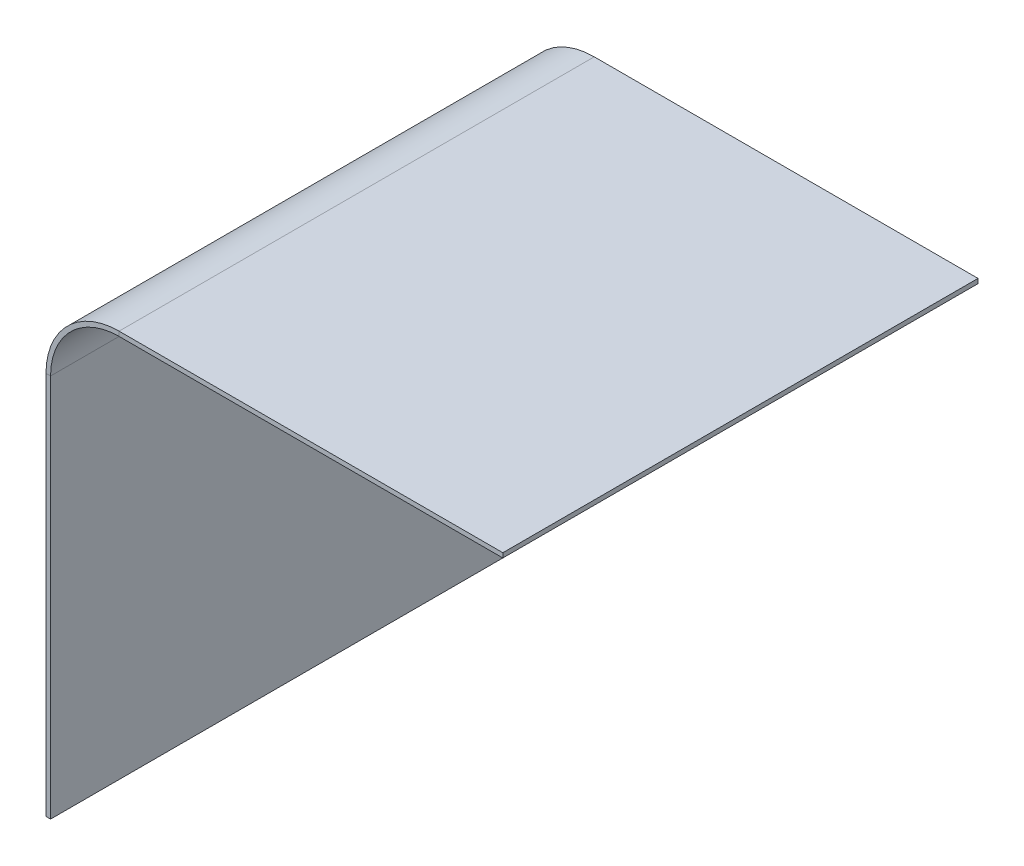
ISO-10303-21;
HEADER;
FILE_DESCRIPTION(('STEP AP214'),'2;1');
FILE_NAME('part.step','',(''),(''),'','','');
FILE_SCHEMA(('AUTOMOTIVE_DESIGN { 1 0 10303 214 1 1 1 1 }'));
ENDSEC;
DATA;
#1=APPLICATION_CONTEXT('core data for automotive mechanical design processes');
#2=APPLICATION_PROTOCOL_DEFINITION('international standard','automotive_design',2000,#1);
#3=PRODUCT_CONTEXT('',#1,'mechanical');
#4=PRODUCT('Part','Part','',(#3));
#5=PRODUCT_RELATED_PRODUCT_CATEGORY('part','',(#4));
#6=PRODUCT_DEFINITION_FORMATION('','',#4);
#7=PRODUCT_DEFINITION_CONTEXT('part definition',#1,'design');
#8=PRODUCT_DEFINITION('design','',#6,#7);
#9=PRODUCT_DEFINITION_SHAPE('','',#8);
#10=(LENGTH_UNIT() NAMED_UNIT(*) SI_UNIT(.MILLI.,.METRE.));
#11=(NAMED_UNIT(*) PLANE_ANGLE_UNIT() SI_UNIT($,.RADIAN.));
#12=(NAMED_UNIT(*) SI_UNIT($,.STERADIAN.) SOLID_ANGLE_UNIT());
#13=UNCERTAINTY_MEASURE_WITH_UNIT(LENGTH_MEASURE(1.E-05),#10,'distance_accuracy_value','');
#14=(GEOMETRIC_REPRESENTATION_CONTEXT(3) GLOBAL_UNCERTAINTY_ASSIGNED_CONTEXT((#13)) GLOBAL_UNIT_ASSIGNED_CONTEXT((#10,
#11,#12)) REPRESENTATION_CONTEXT('',''));
#15=CARTESIAN_POINT('',(0.,0.,0.));
#16=DIRECTION('',(0.,0.,1.));
#17=DIRECTION('',(1.,0.,0.));
#18=AXIS2_PLACEMENT_3D('',#15,#16,#17);
#19=CARTESIAN_POINT('',(0.,84.,104.));
#20=DIRECTION('',(0.,0.,1.));
#21=DIRECTION('',(1.,0.,0.));
#22=AXIS2_PLACEMENT_3D('',#19,#20,#21);
#23=PLANE('',#22);
#24=DIRECTION('',(-1.,0.,0.));
#25=VECTOR('',#24,1.);
#26=CARTESIAN_POINT('',(0.,84.,104.));
#27=LINE('',#26,#25);
#28=CARTESIAN_POINT('',(0.,84.,104.));
#29=VERTEX_POINT('',#28);
#30=CARTESIAN_POINT('',(-1.,84.,104.));
#31=VERTEX_POINT('',#30);
#32=EDGE_CURVE('E11',#29,#31,#27,.T.);
#33=ORIENTED_EDGE('',*,*,#32,.F.);
#34=CARTESIAN_POINT('',(15.,84.,104.));
#35=DIRECTION('',(0.,0.,1.));
#36=DIRECTION('',(1.,0.,0.));
#37=AXIS2_PLACEMENT_3D('',#34,#35,#36);
#38=CIRCLE('',#37,15.);
#39=CARTESIAN_POINT('',(15.,99.,104.));
#40=VERTEX_POINT('',#39);
#41=EDGE_CURVE('E142',#40,#29,#38,.T.);
#42=ORIENTED_EDGE('',*,*,#41,.F.);
#43=DIRECTION('',(0.,-1.,0.));
#44=VECTOR('',#43,1.);
#45=CARTESIAN_POINT('',(15.,100.,104.));
#46=LINE('',#45,#44);
#47=CARTESIAN_POINT('',(15.,100.,104.));
#48=VERTEX_POINT('',#47);
#49=EDGE_CURVE('E49',#48,#40,#46,.T.);
#50=ORIENTED_EDGE('',*,*,#49,.F.);
#51=CARTESIAN_POINT('',(15.,84.,104.));
#52=DIRECTION('',(0.,0.,1.));
#53=DIRECTION('',(1.,0.,0.));
#54=AXIS2_PLACEMENT_3D('',#51,#52,#53);
#55=CIRCLE('',#54,16.);
#56=EDGE_CURVE('E133',#48,#31,#55,.T.);
#57=ORIENTED_EDGE('',*,*,#56,.T.);
#58=EDGE_LOOP('',(#33,#42,#50,#57));
#59=FACE_BOUND('',#58,.T.);
#60=ADVANCED_FACE('F40',(#59),#23,.T.);
#61=CARTESIAN_POINT('',(15.,100.,104.));
#62=DIRECTION('',(0.,0.,1.));
#63=DIRECTION('',(1.,0.,0.));
#64=AXIS2_PLACEMENT_3D('',#61,#62,#63);
#65=PLANE('',#64);
#66=DIRECTION('',(0.,-1.,0.));
#67=VECTOR('',#66,1.);
#68=CARTESIAN_POINT('',(0.,84.,104.));
#69=LINE('',#68,#67);
#70=CARTESIAN_POINT('',(0.,0.,104.));
#71=VERTEX_POINT('',#70);
#72=EDGE_CURVE('E211',#29,#71,#69,.T.);
#73=ORIENTED_EDGE('',*,*,#72,.F.);
#74=ORIENTED_EDGE('',*,*,#32,.T.);
#75=DIRECTION('',(0.,-1.,0.));
#76=VECTOR('',#75,1.);
#77=CARTESIAN_POINT('',(-1.,84.,104.));
#78=LINE('',#77,#76);
#79=CARTESIAN_POINT('',(-1.,0.,104.));
#80=VERTEX_POINT('',#79);
#81=EDGE_CURVE('E97',#31,#80,#78,.T.);
#82=ORIENTED_EDGE('',*,*,#81,.T.);
#83=DIRECTION('',(-1.,0.,0.));
#84=VECTOR('',#83,1.);
#85=CARTESIAN_POINT('',(0.,0.,104.));
#86=LINE('',#85,#84);
#87=EDGE_CURVE('E369',#71,#80,#86,.T.);
#88=ORIENTED_EDGE('',*,*,#87,.F.);
#89=EDGE_LOOP('',(#73,#74,#82,#88));
#90=FACE_BOUND('',#89,.T.);
#91=ADVANCED_FACE('F219',(#90),#65,.T.);
#92=CARTESIAN_POINT('',(15.,99.,0.));
#93=DIRECTION('',(0.,0.,-1.));
#94=DIRECTION('',(-1.,0.,0.));
#95=AXIS2_PLACEMENT_3D('',#92,#93,#94);
#96=PLANE('',#95);
#97=DIRECTION('',(0.,1.,0.));
#98=VECTOR('',#97,1.);
#99=CARTESIAN_POINT('',(15.,99.,0.));
#100=LINE('',#99,#98);
#101=CARTESIAN_POINT('',(15.,99.,0.));
#102=VERTEX_POINT('',#101);
#103=CARTESIAN_POINT('',(15.,100.,0.));
#104=VERTEX_POINT('',#103);
#105=EDGE_CURVE('E84',#102,#104,#100,.T.);
#106=ORIENTED_EDGE('',*,*,#105,.F.);
#107=CARTESIAN_POINT('',(15.,84.,0.));
#108=DIRECTION('',(0.,0.,1.));
#109=DIRECTION('',(1.,0.,0.));
#110=AXIS2_PLACEMENT_3D('',#107,#108,#109);
#111=CIRCLE('',#110,15.);
#112=CARTESIAN_POINT('',(0.,84.,0.));
#113=VERTEX_POINT('',#112);
#114=EDGE_CURVE('E161',#102,#113,#111,.T.);
#115=ORIENTED_EDGE('',*,*,#114,.T.);
#116=DIRECTION('',(1.,0.,0.));
#117=VECTOR('',#116,1.);
#118=CARTESIAN_POINT('',(-1.,84.,0.));
#119=LINE('',#118,#117);
#120=CARTESIAN_POINT('',(-1.,84.,0.));
#121=VERTEX_POINT('',#120);
#122=EDGE_CURVE('E91',#121,#113,#119,.T.);
#123=ORIENTED_EDGE('',*,*,#122,.F.);
#124=CARTESIAN_POINT('',(15.,84.,0.));
#125=DIRECTION('',(0.,0.,1.));
#126=DIRECTION('',(1.,0.,0.));
#127=AXIS2_PLACEMENT_3D('',#124,#125,#126);
#128=CIRCLE('',#127,16.);
#129=EDGE_CURVE('E172',#104,#121,#128,.T.);
#130=ORIENTED_EDGE('',*,*,#129,.F.);
#131=EDGE_LOOP('',(#106,#115,#123,#130));
#132=FACE_BOUND('',#131,.T.);
#133=ADVANCED_FACE('F217',(#132),#96,.T.);
#134=CARTESIAN_POINT('',(-1.,84.,0.));
#135=DIRECTION('',(0.,0.,-1.));
#136=DIRECTION('',(-1.,0.,0.));
#137=AXIS2_PLACEMENT_3D('',#134,#135,#136);
#138=PLANE('',#137);
#139=DIRECTION('',(-1.,0.,0.));
#140=VECTOR('',#139,1.);
#141=CARTESIAN_POINT('',(99.,99.,0.));
#142=LINE('',#141,#140);
#143=CARTESIAN_POINT('',(99.,99.,0.));
#144=VERTEX_POINT('',#143);
#145=EDGE_CURVE('E164',#144,#102,#142,.T.);
#146=ORIENTED_EDGE('',*,*,#145,.T.);
#147=ORIENTED_EDGE('',*,*,#105,.T.);
#148=DIRECTION('',(-1.,0.,0.));
#149=VECTOR('',#148,1.);
#150=CARTESIAN_POINT('',(99.,100.,0.));
#151=LINE('',#150,#149);
#152=CARTESIAN_POINT('',(99.,100.,0.));
#153=VERTEX_POINT('',#152);
#154=EDGE_CURVE('E169',#153,#104,#151,.T.);
#155=ORIENTED_EDGE('',*,*,#154,.F.);
#156=DIRECTION('',(0.,-1.,0.));
#157=VECTOR('',#156,1.);
#158=CARTESIAN_POINT('',(99.,100.,0.));
#159=LINE('',#158,#157);
#160=EDGE_CURVE('E119',#153,#144,#159,.T.);
#161=ORIENTED_EDGE('',*,*,#160,.T.);
#162=EDGE_LOOP('',(#146,#147,#155,#161));
#163=FACE_BOUND('',#162,.T.);
#164=ADVANCED_FACE('F213',(#163),#138,.T.);
#165=CARTESIAN_POINT('',(-1.,84.,104.));
#166=DIRECTION('',(1.,0.,0.));
#167=DIRECTION('',(0.,1.,0.));
#168=AXIS2_PLACEMENT_3D('',#165,#166,#167);
#169=PLANE('',#168);
#170=DIRECTION('',(0.,-1.,0.));
#171=VECTOR('',#170,1.);
#172=CARTESIAN_POINT('',(-1.,84.,0.));
#173=LINE('',#172,#171);
#174=CARTESIAN_POINT('',(-1.,0.,0.));
#175=VERTEX_POINT('',#174);
#176=EDGE_CURVE('E149',#121,#175,#173,.T.);
#177=ORIENTED_EDGE('',*,*,#176,.T.);
#178=DIRECTION('',(0.,0.,-1.));
#179=VECTOR('',#178,1.);
#180=CARTESIAN_POINT('',(-1.,0.,104.));
#181=LINE('',#180,#179);
#182=EDGE_CURVE('E193',#80,#175,#181,.T.);
#183=ORIENTED_EDGE('',*,*,#182,.F.);
#184=ORIENTED_EDGE('',*,*,#81,.F.);
#185=DIRECTION('',(0.,0.,-1.));
#186=VECTOR('',#185,1.);
#187=CARTESIAN_POINT('',(-1.,84.,104.));
#188=LINE('',#187,#186);
#189=EDGE_CURVE('E148',#31,#121,#188,.T.);
#190=ORIENTED_EDGE('',*,*,#189,.T.);
#191=EDGE_LOOP('',(#177,#183,#184,#190));
#192=FACE_BOUND('',#191,.T.);
#193=ADVANCED_FACE('F225',(#192),#169,.F.);
#194=CARTESIAN_POINT('',(0.,0.,104.));
#195=DIRECTION('',(0.,-1.,0.));
#196=DIRECTION('',(0.,0.,-1.));
#197=AXIS2_PLACEMENT_3D('',#194,#195,#196);
#198=PLANE('',#197);
#199=DIRECTION('',(-1.,0.,0.));
#200=VECTOR('',#199,1.);
#201=CARTESIAN_POINT('',(0.,0.,0.));
#202=LINE('',#201,#200);
#203=CARTESIAN_POINT('',(0.,0.,0.));
#204=VERTEX_POINT('',#203);
#205=EDGE_CURVE('E153',#204,#175,#202,.T.);
#206=ORIENTED_EDGE('',*,*,#205,.F.);
#207=DIRECTION('',(0.,0.,-1.));
#208=VECTOR('',#207,1.);
#209=CARTESIAN_POINT('',(0.,0.,104.));
#210=LINE('',#209,#208);
#211=EDGE_CURVE('E190',#71,#204,#210,.T.);
#212=ORIENTED_EDGE('',*,*,#211,.F.);
#213=ORIENTED_EDGE('',*,*,#87,.T.);
#214=ORIENTED_EDGE('',*,*,#182,.T.);
#215=EDGE_LOOP('',(#206,#212,#213,#214));
#216=FACE_BOUND('',#215,.T.);
#217=ADVANCED_FACE('F256',(#216),#198,.T.);
#218=CARTESIAN_POINT('',(0.,84.,104.));
#219=DIRECTION('',(1.,0.,0.));
#220=DIRECTION('',(0.,1.,0.));
#221=AXIS2_PLACEMENT_3D('',#218,#219,#220);
#222=PLANE('',#221);
#223=DIRECTION('',(0.,-1.,0.));
#224=VECTOR('',#223,1.);
#225=CARTESIAN_POINT('',(0.,84.,0.));
#226=LINE('',#225,#224);
#227=EDGE_CURVE('E157',#113,#204,#226,.T.);
#228=ORIENTED_EDGE('',*,*,#227,.F.);
#229=DIRECTION('',(0.,0.,-1.));
#230=VECTOR('',#229,1.);
#231=CARTESIAN_POINT('',(0.,84.,104.));
#232=LINE('',#231,#230);
#233=EDGE_CURVE('E186',#29,#113,#232,.T.);
#234=ORIENTED_EDGE('',*,*,#233,.F.);
#235=ORIENTED_EDGE('',*,*,#72,.T.);
#236=ORIENTED_EDGE('',*,*,#211,.T.);
#237=EDGE_LOOP('',(#228,#234,#235,#236));
#238=FACE_BOUND('',#237,.T.);
#239=ADVANCED_FACE('F267',(#238),#222,.T.);
#240=CARTESIAN_POINT('',(15.,84.,104.));
#241=DIRECTION('',(0.,0.,-1.));
#242=DIRECTION('',(-1.,0.,0.));
#243=AXIS2_PLACEMENT_3D('',#240,#241,#242);
#244=CYLINDRICAL_SURFACE('',#243,15.);
#245=ORIENTED_EDGE('',*,*,#114,.F.);
#246=DIRECTION('',(0.,0.,-1.));
#247=VECTOR('',#246,1.);
#248=CARTESIAN_POINT('',(15.,99.,104.));
#249=LINE('',#248,#247);
#250=EDGE_CURVE('E182',#40,#102,#249,.T.);
#251=ORIENTED_EDGE('',*,*,#250,.F.);
#252=ORIENTED_EDGE('',*,*,#41,.T.);
#253=ORIENTED_EDGE('',*,*,#233,.T.);
#254=EDGE_LOOP('',(#245,#251,#252,#253));
#255=FACE_BOUND('',#254,.T.);
#256=ADVANCED_FACE('F206',(#255),#244,.F.);
#257=CARTESIAN_POINT('',(99.,99.,104.));
#258=DIRECTION('',(0.,-1.,0.));
#259=DIRECTION('',(1.,0.,0.));
#260=AXIS2_PLACEMENT_3D('',#257,#258,#259);
#261=PLANE('',#260);
#262=ORIENTED_EDGE('',*,*,#145,.F.);
#263=DIRECTION('',(0.,0.,-1.));
#264=VECTOR('',#263,1.);
#265=CARTESIAN_POINT('',(99.,99.,104.));
#266=LINE('',#265,#264);
#267=CARTESIAN_POINT('',(99.,99.,104.));
#268=VERTEX_POINT('',#267);
#269=EDGE_CURVE('E122',#268,#144,#266,.T.);
#270=ORIENTED_EDGE('',*,*,#269,.F.);
#271=DIRECTION('',(-1.,0.,0.));
#272=VECTOR('',#271,1.);
#273=CARTESIAN_POINT('',(99.,99.,104.));
#274=LINE('',#273,#272);
#275=EDGE_CURVE('E138',#268,#40,#274,.T.);
#276=ORIENTED_EDGE('',*,*,#275,.T.);
#277=ORIENTED_EDGE('',*,*,#250,.T.);
#278=EDGE_LOOP('',(#262,#270,#276,#277));
#279=FACE_BOUND('',#278,.T.);
#280=ADVANCED_FACE('F212',(#279),#261,.T.);
#281=CARTESIAN_POINT('',(99.,100.,104.));
#282=DIRECTION('',(1.,0.,0.));
#283=DIRECTION('',(0.,0.,-1.));
#284=AXIS2_PLACEMENT_3D('',#281,#282,#283);
#285=PLANE('',#284);
#286=ORIENTED_EDGE('',*,*,#160,.F.);
#287=DIRECTION('',(0.,0.,-1.));
#288=VECTOR('',#287,1.);
#289=CARTESIAN_POINT('',(99.,100.,104.));
#290=LINE('',#289,#288);
#291=CARTESIAN_POINT('',(99.,100.,104.));
#292=VERTEX_POINT('',#291);
#293=EDGE_CURVE('E113',#292,#153,#290,.T.);
#294=ORIENTED_EDGE('',*,*,#293,.F.);
#295=DIRECTION('',(0.,-1.,0.));
#296=VECTOR('',#295,1.);
#297=CARTESIAN_POINT('',(99.,100.,104.));
#298=LINE('',#297,#296);
#299=EDGE_CURVE('E117',#292,#268,#298,.T.);
#300=ORIENTED_EDGE('',*,*,#299,.T.);
#301=ORIENTED_EDGE('',*,*,#269,.T.);
#302=EDGE_LOOP('',(#286,#294,#300,#301));
#303=FACE_BOUND('',#302,.T.);
#304=ADVANCED_FACE('F115',(#303),#285,.T.);
#305=CARTESIAN_POINT('',(99.,100.,104.));
#306=DIRECTION('',(0.,-1.,0.));
#307=DIRECTION('',(1.,0.,0.));
#308=AXIS2_PLACEMENT_3D('',#305,#306,#307);
#309=PLANE('',#308);
#310=ORIENTED_EDGE('',*,*,#154,.T.);
#311=DIRECTION('',(0.,0.,-1.));
#312=VECTOR('',#311,1.);
#313=CARTESIAN_POINT('',(15.,100.,104.));
#314=LINE('',#313,#312);
#315=EDGE_CURVE('E123',#48,#104,#314,.T.);
#316=ORIENTED_EDGE('',*,*,#315,.F.);
#317=DIRECTION('',(-1.,0.,0.));
#318=VECTOR('',#317,1.);
#319=CARTESIAN_POINT('',(99.,100.,104.));
#320=LINE('',#319,#318);
#321=EDGE_CURVE('E127',#292,#48,#320,.T.);
#322=ORIENTED_EDGE('',*,*,#321,.F.);
#323=ORIENTED_EDGE('',*,*,#293,.T.);
#324=EDGE_LOOP('',(#310,#316,#322,#323));
#325=FACE_BOUND('',#324,.T.);
#326=ADVANCED_FACE('F128',(#325),#309,.F.);
#327=CARTESIAN_POINT('',(15.,84.,104.));
#328=DIRECTION('',(0.,0.,-1.));
#329=DIRECTION('',(-1.,0.,0.));
#330=AXIS2_PLACEMENT_3D('',#327,#328,#329);
#331=CYLINDRICAL_SURFACE('',#330,16.);
#332=ORIENTED_EDGE('',*,*,#129,.T.);
#333=ORIENTED_EDGE('',*,*,#189,.F.);
#334=ORIENTED_EDGE('',*,*,#56,.F.);
#335=ORIENTED_EDGE('',*,*,#315,.T.);
#336=EDGE_LOOP('',(#332,#333,#334,#335));
#337=FACE_BOUND('',#336,.T.);
#338=ADVANCED_FACE('F215',(#337),#331,.T.);
#339=CARTESIAN_POINT('',(15.,84.,104.));
#340=DIRECTION('',(0.,0.,1.));
#341=DIRECTION('',(1.,0.,0.));
#342=AXIS2_PLACEMENT_3D('',#339,#340,#341);
#343=PLANE('',#342);
#344=ORIENTED_EDGE('',*,*,#321,.T.);
#345=ORIENTED_EDGE('',*,*,#49,.T.);
#346=ORIENTED_EDGE('',*,*,#275,.F.);
#347=ORIENTED_EDGE('',*,*,#299,.F.);
#348=EDGE_LOOP('',(#344,#345,#346,#347));
#349=FACE_BOUND('',#348,.T.);
#350=ADVANCED_FACE('F136',(#349),#343,.T.);
#351=CARTESIAN_POINT('',(15.,84.,0.));
#352=DIRECTION('',(0.,0.,1.));
#353=DIRECTION('',(1.,0.,0.));
#354=AXIS2_PLACEMENT_3D('',#351,#352,#353);
#355=PLANE('',#354);
#356=ORIENTED_EDGE('',*,*,#176,.F.);
#357=ORIENTED_EDGE('',*,*,#122,.T.);
#358=ORIENTED_EDGE('',*,*,#227,.T.);
#359=ORIENTED_EDGE('',*,*,#205,.T.);
#360=EDGE_LOOP('',(#356,#357,#358,#359));
#361=FACE_BOUND('',#360,.T.);
#362=ADVANCED_FACE('F333',(#361),#355,.F.);
#363=CLOSED_SHELL('',(#60,#91,#133,#164,#193,#217,#239,#256,#280,#304,#326,#338,#350,#362));
#364=MANIFOLD_SOLID_BREP('B2',#363);
#365=ADVANCED_BREP_SHAPE_REPRESENTATION('',(#18,#364),#14);
#366=SHAPE_DEFINITION_REPRESENTATION(#9,#365);
ENDSEC;
END-ISO-10303-21;
